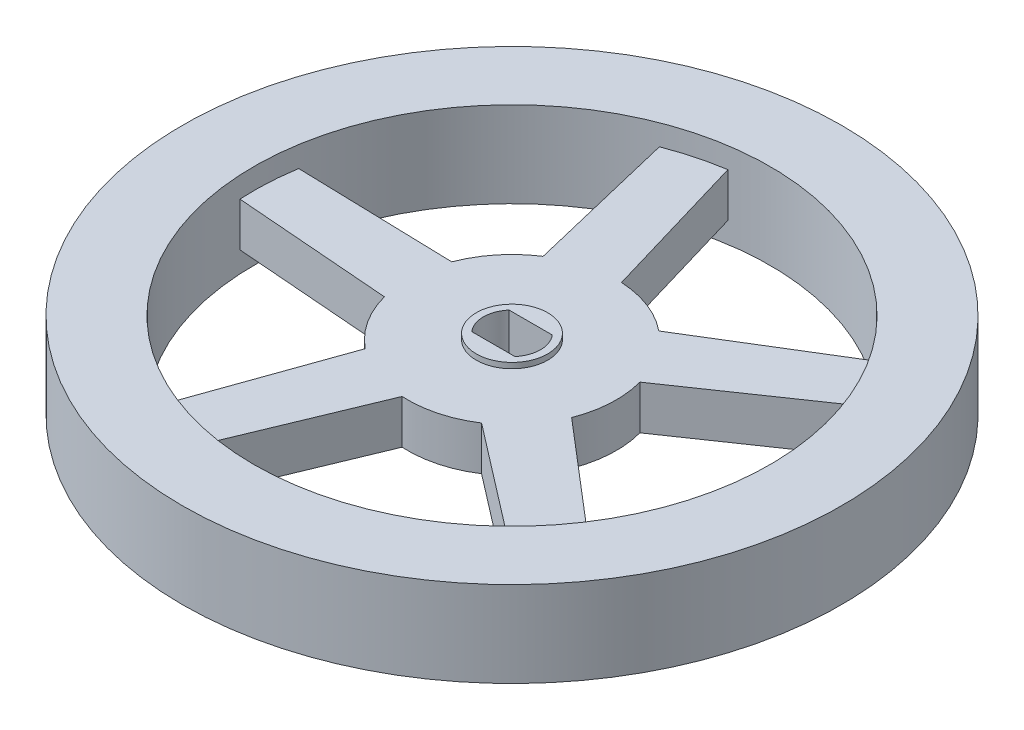
ISO-10303-21;
HEADER;
FILE_DESCRIPTION(('STEP AP214'),'2;1');
FILE_NAME('part.step','',(''),(''),'','','');
FILE_SCHEMA(('AUTOMOTIVE_DESIGN { 1 0 10303 214 1 1 1 1 }'));
ENDSEC;
DATA;
#1=APPLICATION_CONTEXT('core data for automotive mechanical design processes');
#2=APPLICATION_PROTOCOL_DEFINITION('international standard','automotive_design',2000,#1);
#3=PRODUCT_CONTEXT('',#1,'mechanical');
#4=PRODUCT('Part','Part','',(#3));
#5=PRODUCT_RELATED_PRODUCT_CATEGORY('part','',(#4));
#6=PRODUCT_DEFINITION_FORMATION('','',#4);
#7=PRODUCT_DEFINITION_CONTEXT('part definition',#1,'design');
#8=PRODUCT_DEFINITION('design','',#6,#7);
#9=PRODUCT_DEFINITION_SHAPE('','',#8);
#10=(LENGTH_UNIT() NAMED_UNIT(*) SI_UNIT(.MILLI.,.METRE.));
#11=(NAMED_UNIT(*) PLANE_ANGLE_UNIT() SI_UNIT($,.RADIAN.));
#12=(NAMED_UNIT(*) SI_UNIT($,.STERADIAN.) SOLID_ANGLE_UNIT());
#13=UNCERTAINTY_MEASURE_WITH_UNIT(LENGTH_MEASURE(1.E-05),#10,'distance_accuracy_value','');
#14=(GEOMETRIC_REPRESENTATION_CONTEXT(3) GLOBAL_UNCERTAINTY_ASSIGNED_CONTEXT((#13)) GLOBAL_UNIT_ASSIGNED_CONTEXT((#10,
#11,#12)) REPRESENTATION_CONTEXT('',''));
#15=CARTESIAN_POINT('',(0.,0.,0.));
#16=DIRECTION('',(0.,0.,1.));
#17=DIRECTION('',(1.,0.,0.));
#18=AXIS2_PLACEMENT_3D('',#15,#16,#17);
#19=CARTESIAN_POINT('',(-3.0587255926312,4.,0.733926896394335));
#20=DIRECTION('',(-0.972399366290459,0.,0.23332267879037));
#21=DIRECTION('',(0.23332267879037,0.,0.972399366290459));
#22=AXIS2_PLACEMENT_3D('',#19,#20,#21);
#23=PLANE('',#22);
#24=DIRECTION('',(-0.23332267879037,0.,-0.972399366290459));
#25=VECTOR('',#24,1.);
#26=CARTESIAN_POINT('',(-3.0587255926312,0.,0.733926896394335));
#27=LINE('',#26,#25);
#28=CARTESIAN_POINT('',(-5.15025940738791,0.,-7.98278322620703));
#29=VERTEX_POINT('',#28);
#30=CARTESIAN_POINT('',(-8.49246739405931,0.,-21.9118232368016));
#31=VERTEX_POINT('',#30);
#32=EDGE_CURVE('E312',#29,#31,#27,.T.);
#33=ORIENTED_EDGE('',*,*,#32,.F.);
#34=DIRECTION('',(0.,-1.,0.));
#35=VECTOR('',#34,1.);
#36=CARTESIAN_POINT('',(-5.15025940738791,4.,-7.98278322620703));
#37=LINE('',#36,#35);
#38=CARTESIAN_POINT('',(-5.15025940738791,4.,-7.98278322620703));
#39=VERTEX_POINT('',#38);
#40=EDGE_CURVE('E48',#39,#29,#37,.T.);
#41=ORIENTED_EDGE('',*,*,#40,.F.);
#42=DIRECTION('',(-0.23332267879037,0.,-0.972399366290459));
#43=VECTOR('',#42,1.);
#44=CARTESIAN_POINT('',(-3.0587255926312,4.,0.733926896394335));
#45=LINE('',#44,#43);
#46=CARTESIAN_POINT('',(-8.49246739405931,4.,-21.9118232368016));
#47=VERTEX_POINT('',#46);
#48=EDGE_CURVE('E353',#39,#47,#45,.T.);
#49=ORIENTED_EDGE('',*,*,#48,.T.);
#50=DIRECTION('',(0.,-1.,0.));
#51=VECTOR('',#50,1.);
#52=CARTESIAN_POINT('',(-8.49246739405931,4.,-21.9118232368016));
#53=LINE('',#52,#51);
#54=EDGE_CURVE('E11',#47,#31,#53,.T.);
#55=ORIENTED_EDGE('',*,*,#54,.T.);
#56=EDGE_LOOP('',(#33,#41,#49,#55));
#57=FACE_BOUND('',#56,.T.);
#58=ADVANCED_FACE('F41',(#57),#23,.T.);
#59=CARTESIAN_POINT('',(0.,4.,0.));
#60=DIRECTION('',(0.,-1.,0.));
#61=DIRECTION('',(0.,0.,-1.));
#62=AXIS2_PLACEMENT_3D('',#59,#60,#61);
#63=CYLINDRICAL_SURFACE('',#62,9.5);
#64=CARTESIAN_POINT('',(0.,0.,0.));
#65=DIRECTION('',(0.,1.,0.));
#66=DIRECTION('',(0.,0.,1.));
#67=AXIS2_PLACEMENT_3D('',#64,#65,#66);
#68=CIRCLE('',#67,9.5);
#69=CARTESIAN_POINT('',(-8.87498361177693,0.,-3.38890334631771));
#70=VERTEX_POINT('',#69);
#71=EDGE_CURVE('E305',#29,#70,#68,.T.);
#72=ORIENTED_EDGE('',*,*,#71,.T.);
#73=DIRECTION('',(0.,-1.,0.));
#74=VECTOR('',#73,1.);
#75=CARTESIAN_POINT('',(-8.87498361177693,4.,-3.38890334631771));
#76=LINE('',#75,#74);
#77=CARTESIAN_POINT('',(-8.87498361177693,4.,-3.38890334631771));
#78=VERTEX_POINT('',#77);
#79=EDGE_CURVE('E298',#78,#70,#76,.T.);
#80=ORIENTED_EDGE('',*,*,#79,.F.);
#81=CARTESIAN_POINT('',(0.,4.,0.));
#82=DIRECTION('',(0.,1.,0.));
#83=DIRECTION('',(0.,0.,1.));
#84=AXIS2_PLACEMENT_3D('',#81,#82,#83);
#85=CIRCLE('',#84,9.5);
#86=EDGE_CURVE('E306',#39,#78,#85,.T.);
#87=ORIENTED_EDGE('',*,*,#86,.F.);
#88=ORIENTED_EDGE('',*,*,#40,.T.);
#89=EDGE_LOOP('',(#72,#80,#87,#88));
#90=FACE_BOUND('',#89,.T.);
#91=ADVANCED_FACE('F303',(#90),#63,.T.);
#92=CARTESIAN_POINT('',(0.0858062243974081,4.,-3.14437406046434));
#93=DIRECTION('',(-0.0272786543614226,0.,0.999627868267102));
#94=DIRECTION('',(0.999627868267102,0.,0.0272786543614226));
#95=AXIS2_PLACEMENT_3D('',#92,#93,#94);
#96=PLANE('',#95);
#97=DIRECTION('',(-0.999627868267102,0.,-0.0272786543614226));
#98=VECTOR('',#97,1.);
#99=CARTESIAN_POINT('',(0.0858062243974081,0.,-3.14437406046434));
#100=LINE('',#99,#98);
#101=CARTESIAN_POINT('',(-23.1940556468757,0.,-3.77965377377305));
#102=VERTEX_POINT('',#101);
#103=EDGE_CURVE('E314',#70,#102,#100,.T.);
#104=ORIENTED_EDGE('',*,*,#103,.T.);
#105=DIRECTION('',(0.,-1.,0.));
#106=VECTOR('',#105,1.);
#107=CARTESIAN_POINT('',(-23.1940556468757,4.,-3.77965377377305));
#108=LINE('',#107,#106);
#109=CARTESIAN_POINT('',(-23.1940556468757,4.,-3.77965377377305));
#110=VERTEX_POINT('',#109);
#111=EDGE_CURVE('E295',#110,#102,#108,.T.);
#112=ORIENTED_EDGE('',*,*,#111,.F.);
#113=DIRECTION('',(-0.999627868267102,0.,-0.0272786543614226));
#114=VECTOR('',#113,1.);
#115=CARTESIAN_POINT('',(0.0858062243974081,4.,-3.14437406046434));
#116=LINE('',#115,#114);
#117=EDGE_CURVE('E360',#78,#110,#116,.T.);
#118=ORIENTED_EDGE('',*,*,#117,.F.);
#119=ORIENTED_EDGE('',*,*,#79,.T.);
#120=EDGE_LOOP('',(#104,#112,#118,#119));
#121=FACE_BOUND('',#120,.T.);
#122=ADVANCED_FACE('F413',(#121),#96,.F.);
#123=CARTESIAN_POINT('',(-0.24719223195253,4.,3.1358167900456));
#124=DIRECTION('',(-0.078584875440158,0.,0.99690742667113));
#125=DIRECTION('',(0.99690742667113,0.,0.078584875440158));
#126=AXIS2_PLACEMENT_3D('',#123,#124,#125);
#127=PLANE('',#126);
#128=DIRECTION('',(-0.99690742667113,0.,-0.078584875440158));
#129=VECTOR('',#128,1.);
#130=CARTESIAN_POINT('',(-0.24719223195253,0.,3.1358167900456));
#131=LINE('',#130,#129);
#132=CARTESIAN_POINT('',(-9.18359568777773,0.,2.43137209069782));
#133=VERTEX_POINT('',#132);
#134=CARTESIAN_POINT('',(-23.4636990222072,0.,1.3056906966329));
#135=VERTEX_POINT('',#134);
#136=EDGE_CURVE('E327',#133,#135,#131,.T.);
#137=ORIENTED_EDGE('',*,*,#136,.F.);
#138=DIRECTION('',(0.,-1.,0.));
#139=VECTOR('',#138,1.);
#140=CARTESIAN_POINT('',(-9.18359568777773,4.,2.43137209069782));
#141=LINE('',#140,#139);
#142=CARTESIAN_POINT('',(-9.18359568777773,4.,2.43137209069782));
#143=VERTEX_POINT('',#142);
#144=EDGE_CURVE('E290',#143,#133,#141,.T.);
#145=ORIENTED_EDGE('',*,*,#144,.F.);
#146=DIRECTION('',(-0.99690742667113,0.,-0.078584875440158));
#147=VECTOR('',#146,1.);
#148=CARTESIAN_POINT('',(-0.24719223195253,4.,3.1358167900456));
#149=LINE('',#148,#147);
#150=CARTESIAN_POINT('',(-23.4636990222065,4.,1.30569069663296));
#151=VERTEX_POINT('',#150);
#152=EDGE_CURVE('E366',#143,#151,#149,.T.);
#153=ORIENTED_EDGE('',*,*,#152,.T.);
#154=DIRECTION('',(0.,-1.,0.));
#155=VECTOR('',#154,1.);
#156=CARTESIAN_POINT('',(-23.4636990222065,4.,1.30569069663296));
#157=LINE('',#156,#155);
#158=EDGE_CURVE('E292',#151,#135,#157,.T.);
#159=ORIENTED_EDGE('',*,*,#158,.T.);
#160=EDGE_LOOP('',(#137,#145,#153,#159));
#161=FACE_BOUND('',#160,.T.);
#162=ADVANCED_FACE('F419',(#161),#127,.T.);
#163=CARTESIAN_POINT('',(-5.96555937144747,0.,7.39338226968723));
#164=VERTEX_POINT('',#163);
#165=EDGE_CURVE('E233',#133,#164,#68,.T.);
#166=ORIENTED_EDGE('',*,*,#165,.T.);
#167=DIRECTION('',(0.,-1.,0.));
#168=VECTOR('',#167,1.);
#169=CARTESIAN_POINT('',(-5.96555937144747,4.,7.39338226968723));
#170=LINE('',#169,#168);
#171=CARTESIAN_POINT('',(-5.96555937144747,4.,7.39338226968723));
#172=VERTEX_POINT('',#171);
#173=EDGE_CURVE('E287',#172,#164,#170,.T.);
#174=ORIENTED_EDGE('',*,*,#173,.F.);
#175=EDGE_CURVE('E362',#143,#172,#85,.T.);
#176=ORIENTED_EDGE('',*,*,#175,.F.);
#177=ORIENTED_EDGE('',*,*,#144,.T.);
#178=EDGE_LOOP('',(#166,#174,#176,#177));
#179=FACE_BOUND('',#178,.T.);
#180=ADVANCED_FACE('F415',(#179),#63,.T.);
#181=CARTESIAN_POINT('',(-2.96396185831137,4.,-1.05327159020682));
#182=DIRECTION('',(0.942273030204301,0.,0.33484554133153));
#183=DIRECTION('',(0.33484554133153,0.,-0.942273030204301));
#184=AXIS2_PLACEMENT_3D('',#181,#182,#183);
#185=PLANE('',#184);
#186=DIRECTION('',(-0.33484554133153,0.,0.942273030204301));
#187=VECTOR('',#186,1.);
#188=CARTESIAN_POINT('',(-2.96396185831137,0.,-1.05327159020682));
#189=LINE('',#188,#187);
#190=CARTESIAN_POINT('',(-10.7620217142485,0.,20.8908805133246));
#191=VERTEX_POINT('',#190);
#192=EDGE_CURVE('E231',#164,#191,#189,.T.);
#193=ORIENTED_EDGE('',*,*,#192,.T.);
#194=DIRECTION('',(0.,-1.,0.));
#195=VECTOR('',#194,1.);
#196=CARTESIAN_POINT('',(-10.7620217142485,4.,20.8908805133246));
#197=LINE('',#196,#195);
#198=CARTESIAN_POINT('',(-10.7620217142485,4.,20.8908805133246));
#199=VERTEX_POINT('',#198);
#200=EDGE_CURVE('E225',#199,#191,#197,.T.);
#201=ORIENTED_EDGE('',*,*,#200,.F.);
#202=DIRECTION('',(-0.33484554133153,0.,0.942273030204301));
#203=VECTOR('',#202,1.);
#204=CARTESIAN_POINT('',(-2.96396185831137,4.,-1.05327159020682));
#205=LINE('',#204,#203);
#206=EDGE_CURVE('E369',#172,#199,#205,.T.);
#207=ORIENTED_EDGE('',*,*,#206,.F.);
#208=ORIENTED_EDGE('',*,*,#173,.T.);
#209=EDGE_LOOP('',(#193,#201,#207,#208));
#210=FACE_BOUND('',#209,.T.);
#211=ADVANCED_FACE('F422',(#210),#185,.F.);
#212=CARTESIAN_POINT('',(2.90595239153055,4.,1.20411446234669));
#213=DIRECTION('',(0.923831242266764,0.,0.382799994529581));
#214=DIRECTION('',(0.382799994529581,0.,-0.923831242266764));
#215=AXIS2_PLACEMENT_3D('',#212,#213,#214);
#216=PLANE('',#215);
#217=DIRECTION('',(-0.382799994529581,0.,0.923831242266764));
#218=VECTOR('',#217,1.);
#219=CARTESIAN_POINT('',(2.90595239153055,0.,1.20411446234669));
#220=LINE('',#219,#218);
#221=CARTESIAN_POINT('',(-0.525514866594731,0.,9.48545381755582));
#222=VERTEX_POINT('',#221);
#223=CARTESIAN_POINT('',(-6.00889610346141,0.,22.7187844661154));
#224=VERTEX_POINT('',#223);
#225=EDGE_CURVE('E204',#222,#224,#220,.T.);
#226=ORIENTED_EDGE('',*,*,#225,.F.);
#227=DIRECTION('',(0.,-1.,0.));
#228=VECTOR('',#227,1.);
#229=CARTESIAN_POINT('',(-0.525514866594731,4.,9.48545381755582));
#230=LINE('',#229,#228);
#231=CARTESIAN_POINT('',(-0.525514866594731,4.,9.48545381755582));
#232=VERTEX_POINT('',#231);
#233=EDGE_CURVE('E226',#232,#222,#230,.T.);
#234=ORIENTED_EDGE('',*,*,#233,.F.);
#235=DIRECTION('',(-0.382799994529581,0.,0.923831242266764));
#236=VECTOR('',#235,1.);
#237=CARTESIAN_POINT('',(2.90595239153055,4.,1.20411446234669));
#238=LINE('',#237,#236);
#239=CARTESIAN_POINT('',(-6.00889610346117,4.,22.7187844661148));
#240=VERTEX_POINT('',#239);
#241=EDGE_CURVE('E222',#232,#240,#238,.T.);
#242=ORIENTED_EDGE('',*,*,#241,.T.);
#243=DIRECTION('',(0.,-1.,0.));
#244=VECTOR('',#243,1.);
#245=CARTESIAN_POINT('',(-6.00889610346117,4.,22.7187844661148));
#246=LINE('',#245,#244);
#247=EDGE_CURVE('E219',#240,#224,#246,.T.);
#248=ORIENTED_EDGE('',*,*,#247,.T.);
#249=EDGE_LOOP('',(#226,#234,#242,#248));
#250=FACE_BOUND('',#249,.T.);
#251=ADVANCED_FACE('F220',(#250),#216,.T.);
#252=CARTESIAN_POINT('',(5.18806515831765,0.,7.95826488080454));
#253=VERTEX_POINT('',#252);
#254=EDGE_CURVE('E214',#222,#253,#68,.T.);
#255=ORIENTED_EDGE('',*,*,#254,.T.);
#256=DIRECTION('',(0.,-1.,0.));
#257=VECTOR('',#256,1.);
#258=CARTESIAN_POINT('',(5.18806515831765,4.,7.95826488080454));
#259=LINE('',#258,#257);
#260=CARTESIAN_POINT('',(5.18806515831765,4.,7.95826488080454));
#261=VERTEX_POINT('',#260);
#262=EDGE_CURVE('E282',#261,#253,#259,.T.);
#263=ORIENTED_EDGE('',*,*,#262,.F.);
#264=EDGE_CURVE('E374',#232,#261,#85,.T.);
#265=ORIENTED_EDGE('',*,*,#264,.F.);
#266=ORIENTED_EDGE('',*,*,#233,.T.);
#267=EDGE_LOOP('',(#255,#263,#265,#266));
#268=FACE_BOUND('',#267,.T.);
#269=ADVANCED_FACE('F423',(#268),#63,.T.);
#270=CARTESIAN_POINT('',(-1.91763539419199,4.,2.49341641833092));
#271=DIRECTION('',(0.609635413710037,0.,-0.792681942742859));
#272=DIRECTION('',(-0.792681942742859,0.,-0.609635413710037));
#273=AXIS2_PLACEMENT_3D('',#270,#271,#272);
#274=PLANE('',#273);
#275=DIRECTION('',(0.792681942742859,0.,0.609635413710037));
#276=VECTOR('',#275,1.);
#277=CARTESIAN_POINT('',(-1.91763539419199,0.,2.49341641833092));
#278=LINE('',#277,#276);
#279=CARTESIAN_POINT('',(16.5427604398065,0.,16.69092798592));
#280=VERTEX_POINT('',#279);
#281=EDGE_CURVE('E237',#253,#280,#278,.T.);
#282=ORIENTED_EDGE('',*,*,#281,.T.);
#283=DIRECTION('',(0.,-1.,0.));
#284=VECTOR('',#283,1.);
#285=CARTESIAN_POINT('',(16.5427604398065,4.,16.69092798592));
#286=LINE('',#285,#284);
#287=CARTESIAN_POINT('',(16.5427604398065,4.,16.69092798592));
#288=VERTEX_POINT('',#287);
#289=EDGE_CURVE('E279',#288,#280,#286,.T.);
#290=ORIENTED_EDGE('',*,*,#289,.F.);
#291=DIRECTION('',(0.792681942742859,0.,0.609635413710037));
#292=VECTOR('',#291,1.);
#293=CARTESIAN_POINT('',(-1.91763539419199,4.,2.49341641833092));
#294=LINE('',#293,#292);
#295=EDGE_CURVE('E375',#261,#288,#294,.T.);
#296=ORIENTED_EDGE('',*,*,#295,.F.);
#297=ORIENTED_EDGE('',*,*,#262,.T.);
#298=EDGE_LOOP('',(#282,#290,#296,#297));
#299=FACE_BOUND('',#298,.T.);
#300=ADVANCED_FACE('F442',(#299),#274,.F.);
#301=CARTESIAN_POINT('',(2.04316957960767,4.,-2.39163312597102));
#302=DIRECTION('',(0.649543983030057,0.,-0.760324019158575));
#303=DIRECTION('',(-0.760324019158575,0.,-0.649543983030057));
#304=AXIS2_PLACEMENT_3D('',#301,#302,#303);
#305=PLANE('',#304);
#306=DIRECTION('',(0.760324019158575,0.,0.649543983030057));
#307=VECTOR('',#306,1.);
#308=CARTESIAN_POINT('',(2.04316957960767,0.,-2.39163312597102));
#309=LINE('',#308,#307);
#310=CARTESIAN_POINT('',(8.85880963862911,0.,3.43096076726852));
#311=VERTEX_POINT('',#310);
#312=CARTESIAN_POINT('',(19.7499969954013,0.,12.7352902865085));
#313=VERTEX_POINT('',#312);
#314=EDGE_CURVE('E242',#311,#313,#309,.T.);
#315=ORIENTED_EDGE('',*,*,#314,.F.);
#316=DIRECTION('',(0.,-1.,0.));
#317=VECTOR('',#316,1.);
#318=CARTESIAN_POINT('',(8.85880963862911,4.,3.43096076726852));
#319=LINE('',#318,#317);
#320=CARTESIAN_POINT('',(8.85880963862911,4.,3.43096076726852));
#321=VERTEX_POINT('',#320);
#322=EDGE_CURVE('E274',#321,#311,#319,.T.);
#323=ORIENTED_EDGE('',*,*,#322,.F.);
#324=DIRECTION('',(0.760324019158575,0.,0.649543983030057));
#325=VECTOR('',#324,1.);
#326=CARTESIAN_POINT('',(2.04316957960767,4.,-2.39163312597102));
#327=LINE('',#326,#325);
#328=CARTESIAN_POINT('',(19.7499969954014,4.,12.7352902865086));
#329=VERTEX_POINT('',#328);
#330=EDGE_CURVE('E379',#321,#329,#327,.T.);
#331=ORIENTED_EDGE('',*,*,#330,.T.);
#332=DIRECTION('',(0.,-1.,0.));
#333=VECTOR('',#332,1.);
#334=CARTESIAN_POINT('',(19.7499969954014,4.,12.7352902865086));
#335=LINE('',#334,#333);
#336=EDGE_CURVE('E276',#329,#313,#335,.T.);
#337=ORIENTED_EDGE('',*,*,#336,.T.);
#338=EDGE_LOOP('',(#315,#323,#331,#337));
#339=FACE_BOUND('',#338,.T.);
#340=ADVANCED_FACE('F434',(#339),#305,.T.);
#341=CARTESIAN_POINT('',(9.17195997513716,0.,-2.47490408187555));
#342=VERTEX_POINT('',#341);
#343=EDGE_CURVE('E244',#311,#342,#68,.T.);
#344=ORIENTED_EDGE('',*,*,#343,.T.);
#345=DIRECTION('',(0.,-1.,0.));
#346=VECTOR('',#345,1.);
#347=CARTESIAN_POINT('',(9.17195997513716,4.,-2.47490408187555));
#348=LINE('',#347,#346);
#349=CARTESIAN_POINT('',(9.17195997513716,4.,-2.47490408187555));
#350=VERTEX_POINT('',#349);
#351=EDGE_CURVE('E271',#350,#342,#348,.T.);
#352=ORIENTED_EDGE('',*,*,#351,.F.);
#353=EDGE_CURVE('E382',#321,#350,#85,.T.);
#354=ORIENTED_EDGE('',*,*,#353,.F.);
#355=ORIENTED_EDGE('',*,*,#322,.T.);
#356=EDGE_LOOP('',(#344,#352,#354,#355));
#357=FACE_BOUND('',#356,.T.);
#358=ADVANCED_FACE('F426',(#357),#63,.T.);
#359=CARTESIAN_POINT('',(1.77879800667109,4.,2.59428768484282));
#360=DIRECTION('',(-0.565497623785894,0.,-0.824749924214915));
#361=DIRECTION('',(-0.824749924214914,0.,0.565497623785894));
#362=AXIS2_PLACEMENT_3D('',#359,#360,#361);
#363=PLANE('',#362);
#364=DIRECTION('',(0.824749924214915,0.,-0.565497623785894));
#365=VECTOR('',#364,1.);
#366=CARTESIAN_POINT('',(1.77879800667109,0.,2.59428768484282));
#367=LINE('',#366,#365);
#368=CARTESIAN_POINT('',(20.9860099337969,0.,-10.5753197142497));
#369=VERTEX_POINT('',#368);
#370=EDGE_CURVE('E245',#342,#369,#367,.T.);
#371=ORIENTED_EDGE('',*,*,#370,.T.);
#372=DIRECTION('',(0.,-1.,0.));
#373=VECTOR('',#372,1.);
#374=CARTESIAN_POINT('',(20.9860099337969,4.,-10.5753197142497));
#375=LINE('',#374,#373);
#376=CARTESIAN_POINT('',(20.9860099337969,4.,-10.5753197142497));
#377=VERTEX_POINT('',#376);
#378=EDGE_CURVE('E268',#377,#369,#375,.T.);
#379=ORIENTED_EDGE('',*,*,#378,.F.);
#380=DIRECTION('',(0.824749924214915,0.,-0.565497623785894));
#381=VECTOR('',#380,1.);
#382=CARTESIAN_POINT('',(1.77879800667109,4.,2.59428768484282));
#383=LINE('',#382,#381);
#384=EDGE_CURVE('E383',#350,#377,#383,.T.);
#385=ORIENTED_EDGE('',*,*,#384,.F.);
#386=ORIENTED_EDGE('',*,*,#351,.T.);
#387=EDGE_LOOP('',(#371,#379,#385,#386));
#388=FACE_BOUND('',#387,.T.);
#389=ADVANCED_FACE('F432',(#388),#363,.F.);
#390=CARTESIAN_POINT('',(-1.64320414655307,4.,-2.68222502281649));
#391=DIRECTION('',(-0.522390983566204,0.,-0.852706080832507));
#392=DIRECTION('',(-0.852706080832507,0.,0.522390983566204));
#393=AXIS2_PLACEMENT_3D('',#390,#391,#392);
#394=PLANE('',#393);
#395=DIRECTION('',(0.852706080832507,0.,-0.522390983566204));
#396=VECTOR('',#395,1.);
#397=CARTESIAN_POINT('',(-1.64320414655307,0.,-2.68222502281649));
#398=LINE('',#397,#396);
#399=CARTESIAN_POINT('',(6.00056032313339,0.,-7.36500344931647));
#400=VERTEX_POINT('',#399);
#401=CARTESIAN_POINT('',(18.2150655243279,0.,-14.8479422124563));
#402=VERTEX_POINT('',#401);
#403=EDGE_CURVE('E250',#400,#402,#398,.T.);
#404=ORIENTED_EDGE('',*,*,#403,.F.);
#405=DIRECTION('',(0.,-1.,0.));
#406=VECTOR('',#405,1.);
#407=CARTESIAN_POINT('',(6.00056032313339,4.,-7.36500344931647));
#408=LINE('',#407,#406);
#409=CARTESIAN_POINT('',(6.00056032313339,4.,-7.36500344931647));
#410=VERTEX_POINT('',#409);
#411=EDGE_CURVE('E263',#410,#400,#408,.T.);
#412=ORIENTED_EDGE('',*,*,#411,.F.);
#413=DIRECTION('',(0.852706080832507,0.,-0.522390983566204));
#414=VECTOR('',#413,1.);
#415=CARTESIAN_POINT('',(-1.64320414655307,4.,-2.68222502281649));
#416=LINE('',#415,#414);
#417=CARTESIAN_POINT('',(18.2150655243284,4.,-14.8479422124566));
#418=VERTEX_POINT('',#417);
#419=EDGE_CURVE('E387',#410,#418,#416,.T.);
#420=ORIENTED_EDGE('',*,*,#419,.T.);
#421=DIRECTION('',(0.,-1.,0.));
#422=VECTOR('',#421,1.);
#423=CARTESIAN_POINT('',(18.2150655243284,4.,-14.8479422124566));
#424=LINE('',#423,#422);
#425=EDGE_CURVE('E265',#418,#402,#424,.T.);
#426=ORIENTED_EDGE('',*,*,#425,.T.);
#427=EDGE_LOOP('',(#404,#412,#420,#426));
#428=FACE_BOUND('',#427,.T.);
#429=ADVANCED_FACE('F425',(#428),#394,.T.);
#430=CARTESIAN_POINT('',(0.480517849771723,0.,-9.48783972229984));
#431=VERTEX_POINT('',#430);
#432=EDGE_CURVE('E252',#400,#431,#68,.T.);
#433=ORIENTED_EDGE('',*,*,#432,.T.);
#434=DIRECTION('',(0.,-1.,0.));
#435=VECTOR('',#434,1.);
#436=CARTESIAN_POINT('',(0.480517849771723,4.,-9.48783972229984));
#437=LINE('',#436,#435);
#438=CARTESIAN_POINT('',(0.480517849771723,4.,-9.48783972229984));
#439=VERTEX_POINT('',#438);
#440=EDGE_CURVE('E259',#439,#431,#437,.T.);
#441=ORIENTED_EDGE('',*,*,#440,.F.);
#442=EDGE_CURVE('E361',#410,#439,#85,.T.);
#443=ORIENTED_EDGE('',*,*,#442,.F.);
#444=ORIENTED_EDGE('',*,*,#411,.T.);
#445=EDGE_LOOP('',(#433,#441,#443,#444));
#446=FACE_BOUND('',#445,.T.);
#447=ADVANCED_FACE('F340',(#446),#63,.T.);
#448=CARTESIAN_POINT('',(3.01699302143628,4.,-0.890058452503478));
#449=DIRECTION('',(-0.95913216576702,0.,0.282958457359141));
#450=DIRECTION('',(0.282958457359141,0.,0.95913216576702));
#451=AXIS2_PLACEMENT_3D('',#448,#449,#450);
#452=PLANE('',#451);
#453=DIRECTION('',(-0.282958457359141,0.,-0.95913216576702));
#454=VECTOR('',#453,1.);
#455=CARTESIAN_POINT('',(3.01699302143628,0.,-0.890058452503478));
#456=LINE('',#455,#454);
#457=CARTESIAN_POINT('',(-3.57269301247632,0.,-23.2268350112236));
#458=VERTEX_POINT('',#457);
#459=EDGE_CURVE('E253',#431,#458,#456,.T.);
#460=ORIENTED_EDGE('',*,*,#459,.T.);
#461=DIRECTION('',(0.,-1.,0.));
#462=VECTOR('',#461,1.);
#463=CARTESIAN_POINT('',(-3.57269301247632,4.,-23.2268350112236));
#464=LINE('',#463,#462);
#465=CARTESIAN_POINT('',(-3.57269301247632,4.,-23.2268350112236));
#466=VERTEX_POINT('',#465);
#467=EDGE_CURVE('E256',#466,#458,#464,.T.);
#468=ORIENTED_EDGE('',*,*,#467,.F.);
#469=DIRECTION('',(-0.282958457359141,0.,-0.95913216576702));
#470=VECTOR('',#469,1.);
#471=CARTESIAN_POINT('',(3.01699302143628,4.,-0.890058452503478));
#472=LINE('',#471,#470);
#473=EDGE_CURVE('E348',#439,#466,#472,.T.);
#474=ORIENTED_EDGE('',*,*,#473,.F.);
#475=ORIENTED_EDGE('',*,*,#440,.T.);
#476=EDGE_LOOP('',(#460,#468,#474,#475));
#477=FACE_BOUND('',#476,.T.);
#478=ADVANCED_FACE('F346',(#477),#452,.F.);
#479=CARTESIAN_POINT('',(0.,4.,0.));
#480=DIRECTION('',(0.,1.,0.));
#481=DIRECTION('',(0.,0.,1.));
#482=AXIS2_PLACEMENT_3D('',#479,#480,#481);
#483=PLANE('',#482);
#484=CARTESIAN_POINT('',(0.,4.,0.));
#485=DIRECTION('',(0.,1.,0.));
#486=DIRECTION('',(0.,0.,1.));
#487=AXIS2_PLACEMENT_3D('',#484,#485,#486);
#488=CIRCLE('',#487,23.5);
#489=EDGE_CURVE('E255',#466,#47,#488,.T.);
#490=ORIENTED_EDGE('',*,*,#489,.T.);
#491=ORIENTED_EDGE('',*,*,#48,.F.);
#492=ORIENTED_EDGE('',*,*,#86,.T.);
#493=ORIENTED_EDGE('',*,*,#117,.T.);
#494=CARTESIAN_POINT('',(0.,4.,0.));
#495=DIRECTION('',(0.,1.,0.));
#496=DIRECTION('',(0.,0.,1.));
#497=AXIS2_PLACEMENT_3D('',#494,#495,#496);
#498=CIRCLE('',#497,23.5);
#499=EDGE_CURVE('E364',#110,#151,#498,.T.);
#500=ORIENTED_EDGE('',*,*,#499,.T.);
#501=ORIENTED_EDGE('',*,*,#152,.F.);
#502=ORIENTED_EDGE('',*,*,#175,.T.);
#503=ORIENTED_EDGE('',*,*,#206,.T.);
#504=CARTESIAN_POINT('',(0.,4.,0.));
#505=DIRECTION('',(0.,1.,0.));
#506=DIRECTION('',(0.,0.,1.));
#507=AXIS2_PLACEMENT_3D('',#504,#505,#506);
#508=CIRCLE('',#507,23.5);
#509=EDGE_CURVE('E371',#199,#240,#508,.T.);
#510=ORIENTED_EDGE('',*,*,#509,.T.);
#511=ORIENTED_EDGE('',*,*,#241,.F.);
#512=ORIENTED_EDGE('',*,*,#264,.T.);
#513=ORIENTED_EDGE('',*,*,#295,.T.);
#514=CARTESIAN_POINT('',(0.,4.,0.));
#515=DIRECTION('',(0.,1.,0.));
#516=DIRECTION('',(0.,0.,1.));
#517=AXIS2_PLACEMENT_3D('',#514,#515,#516);
#518=CIRCLE('',#517,23.5);
#519=EDGE_CURVE('E377',#288,#329,#518,.T.);
#520=ORIENTED_EDGE('',*,*,#519,.T.);
#521=ORIENTED_EDGE('',*,*,#330,.F.);
#522=ORIENTED_EDGE('',*,*,#353,.T.);
#523=ORIENTED_EDGE('',*,*,#384,.T.);
#524=CARTESIAN_POINT('',(0.,4.,0.));
#525=DIRECTION('',(0.,1.,0.));
#526=DIRECTION('',(0.,0.,1.));
#527=AXIS2_PLACEMENT_3D('',#524,#525,#526);
#528=CIRCLE('',#527,23.5);
#529=EDGE_CURVE('E385',#377,#418,#528,.T.);
#530=ORIENTED_EDGE('',*,*,#529,.T.);
#531=ORIENTED_EDGE('',*,*,#419,.F.);
#532=ORIENTED_EDGE('',*,*,#442,.T.);
#533=ORIENTED_EDGE('',*,*,#473,.T.);
#534=EDGE_LOOP('',(#490,#491,#492,#493,#500,#501,#502,#503,#510,#511,#512,#513,#520,#521,#522,
#523,#530,#531,#532,#533));
#535=FACE_BOUND('',#534,.T.);
#536=CARTESIAN_POINT('',(0.,4.,0.));
#537=DIRECTION('',(0.,1.,0.));
#538=DIRECTION('',(0.,0.,1.));
#539=AXIS2_PLACEMENT_3D('',#536,#537,#538);
#540=CIRCLE('',#539,3.25);
#541=CARTESIAN_POINT('',(0.,4.,3.25));
#542=VERTEX_POINT('',#541);
#543=EDGE_CURVE('E260',#542,#542,#540,.T.);
#544=ORIENTED_EDGE('',*,*,#543,.F.);
#545=EDGE_LOOP('',(#544));
#546=FACE_BOUND('',#545,.T.);
#547=ADVANCED_FACE('F396',(#535,#546),#483,.T.);
#548=CARTESIAN_POINT('',(0.,0.,0.));
#549=DIRECTION('',(0.,1.,0.));
#550=DIRECTION('',(0.,0.,1.));
#551=AXIS2_PLACEMENT_3D('',#548,#549,#550);
#552=PLANE('',#551);
#553=CARTESIAN_POINT('',(0.,0.,0.));
#554=DIRECTION('',(0.,1.,0.));
#555=DIRECTION('',(0.,0.,1.));
#556=AXIS2_PLACEMENT_3D('',#553,#554,#555);
#557=CIRCLE('',#556,23.5);
#558=EDGE_CURVE('E318',#458,#31,#557,.T.);
#559=ORIENTED_EDGE('',*,*,#558,.F.);
#560=ORIENTED_EDGE('',*,*,#459,.F.);
#561=ORIENTED_EDGE('',*,*,#432,.F.);
#562=ORIENTED_EDGE('',*,*,#403,.T.);
#563=CARTESIAN_POINT('',(0.,0.,0.));
#564=DIRECTION('',(0.,1.,0.));
#565=DIRECTION('',(0.,0.,1.));
#566=AXIS2_PLACEMENT_3D('',#563,#564,#565);
#567=CIRCLE('',#566,23.5);
#568=EDGE_CURVE('E247',#369,#402,#567,.T.);
#569=ORIENTED_EDGE('',*,*,#568,.F.);
#570=ORIENTED_EDGE('',*,*,#370,.F.);
#571=ORIENTED_EDGE('',*,*,#343,.F.);
#572=ORIENTED_EDGE('',*,*,#314,.T.);
#573=CARTESIAN_POINT('',(0.,0.,0.));
#574=DIRECTION('',(0.,1.,0.));
#575=DIRECTION('',(0.,0.,1.));
#576=AXIS2_PLACEMENT_3D('',#573,#574,#575);
#577=CIRCLE('',#576,23.5);
#578=EDGE_CURVE('E239',#280,#313,#577,.T.);
#579=ORIENTED_EDGE('',*,*,#578,.F.);
#580=ORIENTED_EDGE('',*,*,#281,.F.);
#581=ORIENTED_EDGE('',*,*,#254,.F.);
#582=ORIENTED_EDGE('',*,*,#225,.T.);
#583=CARTESIAN_POINT('',(0.,0.,0.));
#584=DIRECTION('',(0.,1.,0.));
#585=DIRECTION('',(0.,0.,1.));
#586=AXIS2_PLACEMENT_3D('',#583,#584,#585);
#587=CIRCLE('',#586,23.5);
#588=EDGE_CURVE('E211',#191,#224,#587,.T.);
#589=ORIENTED_EDGE('',*,*,#588,.F.);
#590=ORIENTED_EDGE('',*,*,#192,.F.);
#591=ORIENTED_EDGE('',*,*,#165,.F.);
#592=ORIENTED_EDGE('',*,*,#136,.T.);
#593=CARTESIAN_POINT('',(0.,0.,0.));
#594=DIRECTION('',(0.,1.,0.));
#595=DIRECTION('',(0.,0.,1.));
#596=AXIS2_PLACEMENT_3D('',#593,#594,#595);
#597=CIRCLE('',#596,23.5);
#598=EDGE_CURVE('E325',#102,#135,#597,.T.);
#599=ORIENTED_EDGE('',*,*,#598,.F.);
#600=ORIENTED_EDGE('',*,*,#103,.F.);
#601=ORIENTED_EDGE('',*,*,#71,.F.);
#602=ORIENTED_EDGE('',*,*,#32,.T.);
#603=EDGE_LOOP('',(#559,#560,#561,#562,#569,#570,#571,#572,#579,#580,#581,#582,#589,#590,#591,
#592,#599,#600,#601,#602));
#604=FACE_BOUND('',#603,.T.);
#605=CARTESIAN_POINT('',(0.,0.,0.));
#606=DIRECTION('',(0.,1.,0.));
#607=DIRECTION('',(0.,0.,1.));
#608=AXIS2_PLACEMENT_3D('',#605,#606,#607);
#609=CIRCLE('',#608,1.);
#610=CARTESIAN_POINT('',(0.,0.,1.));
#611=VERTEX_POINT('',#610);
#612=EDGE_CURVE('E537',#611,#611,#609,.T.);
#613=ORIENTED_EDGE('',*,*,#612,.T.);
#614=EDGE_LOOP('',(#613));
#615=FACE_BOUND('',#614,.T.);
#616=ADVANCED_FACE('F207',(#604,#615),#552,.F.);
#617=CARTESIAN_POINT('',(0.,4.5,-1.7));
#618=DIRECTION('',(0.,0.,-1.));
#619=DIRECTION('',(-1.,0.,0.));
#620=AXIS2_PLACEMENT_3D('',#617,#618,#619);
#621=PLANE('',#620);
#622=DIRECTION('',(0.,-1.,0.));
#623=VECTOR('',#622,1.);
#624=CARTESIAN_POINT('',(-1.9672315572906,4.5,-1.7));
#625=LINE('',#624,#623);
#626=CARTESIAN_POINT('',(-1.9672315572906,4.5,-1.7));
#627=VERTEX_POINT('',#626);
#628=CARTESIAN_POINT('',(-1.9672315572906,0.5,-1.7));
#629=VERTEX_POINT('',#628);
#630=EDGE_CURVE('E523',#627,#629,#625,.T.);
#631=ORIENTED_EDGE('',*,*,#630,.T.);
#632=DIRECTION('',(1.,0.,0.));
#633=VECTOR('',#632,1.);
#634=CARTESIAN_POINT('',(0.,0.5,-1.7));
#635=LINE('',#634,#633);
#636=CARTESIAN_POINT('',(1.9672315572906,0.5,-1.7));
#637=VERTEX_POINT('',#636);
#638=EDGE_CURVE('E55',#629,#637,#635,.T.);
#639=ORIENTED_EDGE('',*,*,#638,.T.);
#640=DIRECTION('',(0.,-1.,0.));
#641=VECTOR('',#640,1.);
#642=CARTESIAN_POINT('',(1.9672315572906,4.5,-1.7));
#643=LINE('',#642,#641);
#644=CARTESIAN_POINT('',(1.9672315572906,4.5,-1.7));
#645=VERTEX_POINT('',#644);
#646=EDGE_CURVE('E320',#645,#637,#643,.T.);
#647=ORIENTED_EDGE('',*,*,#646,.F.);
#648=DIRECTION('',(1.,0.,0.));
#649=VECTOR('',#648,1.);
#650=CARTESIAN_POINT('',(0.,4.5,-1.7));
#651=LINE('',#650,#649);
#652=EDGE_CURVE('E524',#627,#645,#651,.T.);
#653=ORIENTED_EDGE('',*,*,#652,.F.);
#654=EDGE_LOOP('',(#631,#639,#647,#653));
#655=FACE_BOUND('',#654,.T.);
#656=ADVANCED_FACE('F403',(#655),#621,.F.);
#657=CARTESIAN_POINT('',(0.,4.5,0.));
#658=DIRECTION('',(0.,-1.,0.));
#659=DIRECTION('',(0.,0.,-1.));
#660=AXIS2_PLACEMENT_3D('',#657,#658,#659);
#661=CYLINDRICAL_SURFACE('',#660,2.6);
#662=CARTESIAN_POINT('',(0.,0.5,0.));
#663=DIRECTION('',(0.,1.,0.));
#664=DIRECTION('',(0.,0.,1.));
#665=AXIS2_PLACEMENT_3D('',#662,#663,#664);
#666=CIRCLE('',#665,2.6);
#667=CARTESIAN_POINT('',(1.9672315572906,0.5,1.7));
#668=VERTEX_POINT('',#667);
#669=EDGE_CURVE('E62',#668,#637,#666,.T.);
#670=ORIENTED_EDGE('',*,*,#669,.F.);
#671=DIRECTION('',(0.,-1.,0.));
#672=VECTOR('',#671,1.);
#673=CARTESIAN_POINT('',(1.9672315572906,4.5,1.7));
#674=LINE('',#673,#672);
#675=CARTESIAN_POINT('',(1.9672315572906,4.5,1.7));
#676=VERTEX_POINT('',#675);
#677=EDGE_CURVE('E558',#676,#668,#674,.T.);
#678=ORIENTED_EDGE('',*,*,#677,.F.);
#679=CARTESIAN_POINT('',(0.,4.5,0.));
#680=DIRECTION('',(0.,1.,0.));
#681=DIRECTION('',(0.,0.,1.));
#682=AXIS2_PLACEMENT_3D('',#679,#680,#681);
#683=CIRCLE('',#682,2.6);
#684=EDGE_CURVE('E549',#676,#645,#683,.T.);
#685=ORIENTED_EDGE('',*,*,#684,.T.);
#686=ORIENTED_EDGE('',*,*,#646,.T.);
#687=EDGE_LOOP('',(#670,#678,#685,#686));
#688=FACE_BOUND('',#687,.T.);
#689=ADVANCED_FACE('F515',(#688),#661,.F.);
#690=CARTESIAN_POINT('',(0.,4.5,1.7));
#691=DIRECTION('',(0.,0.,-1.));
#692=DIRECTION('',(-1.,0.,0.));
#693=AXIS2_PLACEMENT_3D('',#690,#691,#692);
#694=PLANE('',#693);
#695=DIRECTION('',(1.,0.,0.));
#696=VECTOR('',#695,1.);
#697=CARTESIAN_POINT('',(0.,0.5,1.7));
#698=LINE('',#697,#696);
#699=CARTESIAN_POINT('',(-1.9672315572906,0.5,1.7));
#700=VERTEX_POINT('',#699);
#701=EDGE_CURVE('E535',#700,#668,#698,.T.);
#702=ORIENTED_EDGE('',*,*,#701,.F.);
#703=DIRECTION('',(0.,-1.,0.));
#704=VECTOR('',#703,1.);
#705=CARTESIAN_POINT('',(-1.9672315572906,4.5,1.7));
#706=LINE('',#705,#704);
#707=CARTESIAN_POINT('',(-1.9672315572906,4.5,1.7));
#708=VERTEX_POINT('',#707);
#709=EDGE_CURVE('E527',#708,#700,#706,.T.);
#710=ORIENTED_EDGE('',*,*,#709,.F.);
#711=DIRECTION('',(1.,0.,0.));
#712=VECTOR('',#711,1.);
#713=CARTESIAN_POINT('',(0.,4.5,1.7));
#714=LINE('',#713,#712);
#715=EDGE_CURVE('E552',#708,#676,#714,.T.);
#716=ORIENTED_EDGE('',*,*,#715,.T.);
#717=ORIENTED_EDGE('',*,*,#677,.T.);
#718=EDGE_LOOP('',(#702,#710,#716,#717));
#719=FACE_BOUND('',#718,.T.);
#720=ADVANCED_FACE('F513',(#719),#694,.T.);
#721=CARTESIAN_POINT('',(0.,0.5,0.));
#722=DIRECTION('',(0.,1.,0.));
#723=DIRECTION('',(0.,0.,1.));
#724=AXIS2_PLACEMENT_3D('',#721,#722,#723);
#725=CIRCLE('',#724,2.6);
#726=EDGE_CURVE('E533',#629,#700,#725,.T.);
#727=ORIENTED_EDGE('',*,*,#726,.F.);
#728=ORIENTED_EDGE('',*,*,#630,.F.);
#729=EDGE_CURVE('E553',#627,#708,#683,.T.);
#730=ORIENTED_EDGE('',*,*,#729,.T.);
#731=ORIENTED_EDGE('',*,*,#709,.T.);
#732=EDGE_LOOP('',(#727,#728,#730,#731));
#733=FACE_BOUND('',#732,.T.);
#734=ADVANCED_FACE('F510',(#733),#661,.F.);
#735=CARTESIAN_POINT('',(0.,4.5,0.));
#736=DIRECTION('',(0.,-1.,0.));
#737=DIRECTION('',(0.,0.,-1.));
#738=AXIS2_PLACEMENT_3D('',#735,#736,#737);
#739=CYLINDRICAL_SURFACE('',#738,3.25);
#740=ORIENTED_EDGE('',*,*,#543,.T.);
#741=EDGE_LOOP('',(#740));
#742=FACE_BOUND('',#741,.T.);
#743=CARTESIAN_POINT('',(0.,4.5,0.));
#744=DIRECTION('',(0.,1.,0.));
#745=DIRECTION('',(0.,0.,1.));
#746=AXIS2_PLACEMENT_3D('',#743,#744,#745);
#747=CIRCLE('',#746,3.25);
#748=CARTESIAN_POINT('',(0.,4.5,3.25));
#749=VERTEX_POINT('',#748);
#750=EDGE_CURVE('E528',#749,#749,#747,.T.);
#751=ORIENTED_EDGE('',*,*,#750,.F.);
#752=EDGE_LOOP('',(#751));
#753=FACE_BOUND('',#752,.T.);
#754=ADVANCED_FACE('F393',(#742,#753),#739,.T.);
#755=CARTESIAN_POINT('',(0.,4.5,0.));
#756=DIRECTION('',(0.,1.,0.));
#757=DIRECTION('',(0.,0.,1.));
#758=AXIS2_PLACEMENT_3D('',#755,#756,#757);
#759=PLANE('',#758);
#760=ORIENTED_EDGE('',*,*,#652,.T.);
#761=ORIENTED_EDGE('',*,*,#684,.F.);
#762=ORIENTED_EDGE('',*,*,#715,.F.);
#763=ORIENTED_EDGE('',*,*,#729,.F.);
#764=EDGE_LOOP('',(#760,#761,#762,#763));
#765=FACE_BOUND('',#764,.T.);
#766=ORIENTED_EDGE('',*,*,#750,.T.);
#767=EDGE_LOOP('',(#766));
#768=FACE_BOUND('',#767,.T.);
#769=ADVANCED_FACE('F504',(#765,#768),#759,.T.);
#770=CARTESIAN_POINT('',(0.,0.5,0.));
#771=DIRECTION('',(0.,-1.,0.));
#772=DIRECTION('',(0.,0.,-1.));
#773=AXIS2_PLACEMENT_3D('',#770,#771,#772);
#774=CYLINDRICAL_SURFACE('',#773,1.);
#775=CARTESIAN_POINT('',(0.,0.5,0.));
#776=DIRECTION('',(0.,1.,0.));
#777=DIRECTION('',(0.,0.,1.));
#778=AXIS2_PLACEMENT_3D('',#775,#776,#777);
#779=CIRCLE('',#778,1.);
#780=CARTESIAN_POINT('',(0.,0.5,1.));
#781=VERTEX_POINT('',#780);
#782=EDGE_CURVE('E542',#781,#781,#779,.T.);
#783=ORIENTED_EDGE('',*,*,#782,.T.);
#784=EDGE_LOOP('',(#783));
#785=FACE_BOUND('',#784,.T.);
#786=ORIENTED_EDGE('',*,*,#612,.F.);
#787=EDGE_LOOP('',(#786));
#788=FACE_BOUND('',#787,.T.);
#789=ADVANCED_FACE('F497',(#785,#788),#774,.F.);
#790=CARTESIAN_POINT('',(0.,0.5,0.));
#791=DIRECTION('',(0.,1.,0.));
#792=DIRECTION('',(0.,0.,1.));
#793=AXIS2_PLACEMENT_3D('',#790,#791,#792);
#794=PLANE('',#793);
#795=ORIENTED_EDGE('',*,*,#669,.T.);
#796=ORIENTED_EDGE('',*,*,#638,.F.);
#797=ORIENTED_EDGE('',*,*,#726,.T.);
#798=ORIENTED_EDGE('',*,*,#701,.T.);
#799=EDGE_LOOP('',(#795,#796,#797,#798));
#800=FACE_BOUND('',#799,.T.);
#801=ORIENTED_EDGE('',*,*,#782,.F.);
#802=EDGE_LOOP('',(#801));
#803=FACE_BOUND('',#802,.T.);
#804=ADVANCED_FACE('F489',(#800,#803),#794,.T.);
#805=CARTESIAN_POINT('',(0.,-1.9,0.));
#806=DIRECTION('',(0.,1.,0.));
#807=DIRECTION('',(0.,0.,1.));
#808=AXIS2_PLACEMENT_3D('',#805,#806,#807);
#809=CYLINDRICAL_SURFACE('',#808,23.5);
#810=ORIENTED_EDGE('',*,*,#519,.F.);
#811=ORIENTED_EDGE('',*,*,#289,.T.);
#812=ORIENTED_EDGE('',*,*,#578,.T.);
#813=ORIENTED_EDGE('',*,*,#336,.F.);
#814=EDGE_LOOP('',(#810,#811,#812,#813));
#815=FACE_BOUND('',#814,.T.);
#816=ORIENTED_EDGE('',*,*,#529,.F.);
#817=ORIENTED_EDGE('',*,*,#378,.T.);
#818=ORIENTED_EDGE('',*,*,#568,.T.);
#819=ORIENTED_EDGE('',*,*,#425,.F.);
#820=EDGE_LOOP('',(#816,#817,#818,#819));
#821=FACE_BOUND('',#820,.T.);
#822=ORIENTED_EDGE('',*,*,#489,.F.);
#823=ORIENTED_EDGE('',*,*,#467,.T.);
#824=ORIENTED_EDGE('',*,*,#558,.T.);
#825=ORIENTED_EDGE('',*,*,#54,.F.);
#826=EDGE_LOOP('',(#822,#823,#824,#825));
#827=FACE_BOUND('',#826,.T.);
#828=ORIENTED_EDGE('',*,*,#499,.F.);
#829=ORIENTED_EDGE('',*,*,#111,.T.);
#830=ORIENTED_EDGE('',*,*,#598,.T.);
#831=ORIENTED_EDGE('',*,*,#158,.F.);
#832=EDGE_LOOP('',(#828,#829,#830,#831));
#833=FACE_BOUND('',#832,.T.);
#834=ORIENTED_EDGE('',*,*,#509,.F.);
#835=ORIENTED_EDGE('',*,*,#200,.T.);
#836=ORIENTED_EDGE('',*,*,#588,.T.);
#837=ORIENTED_EDGE('',*,*,#247,.F.);
#838=EDGE_LOOP('',(#834,#835,#836,#837));
#839=FACE_BOUND('',#838,.T.);
#840=CARTESIAN_POINT('',(0.,-1.9,0.));
#841=DIRECTION('',(0.,1.,0.));
#842=DIRECTION('',(0.,0.,1.));
#843=AXIS2_PLACEMENT_3D('',#840,#841,#842);
#844=CIRCLE('',#843,23.5);
#845=CARTESIAN_POINT('',(0.,-1.9,23.5));
#846=VERTEX_POINT('',#845);
#847=EDGE_CURVE('E566',#846,#846,#844,.T.);
#848=ORIENTED_EDGE('',*,*,#847,.F.);
#849=EDGE_LOOP('',(#848));
#850=FACE_BOUND('',#849,.T.);
#851=CARTESIAN_POINT('',(0.,5.9,0.));
#852=DIRECTION('',(0.,1.,0.));
#853=DIRECTION('',(0.,0.,1.));
#854=AXIS2_PLACEMENT_3D('',#851,#852,#853);
#855=CIRCLE('',#854,23.5);
#856=CARTESIAN_POINT('',(0.,5.9,23.5));
#857=VERTEX_POINT('',#856);
#858=EDGE_CURVE('E574',#857,#857,#855,.T.);
#859=ORIENTED_EDGE('',*,*,#858,.T.);
#860=EDGE_LOOP('',(#859));
#861=FACE_BOUND('',#860,.T.);
#862=ADVANCED_FACE('F228',(#815,#821,#827,#833,#839,#850,#861),#809,.F.);
#863=CARTESIAN_POINT('',(0.,-1.9,0.));
#864=DIRECTION('',(0.,1.,0.));
#865=DIRECTION('',(0.,0.,1.));
#866=AXIS2_PLACEMENT_3D('',#863,#864,#865);
#867=CYLINDRICAL_SURFACE('',#866,30.);
#868=CARTESIAN_POINT('',(0.,-1.9,0.));
#869=DIRECTION('',(0.,1.,0.));
#870=DIRECTION('',(0.,0.,1.));
#871=AXIS2_PLACEMENT_3D('',#868,#869,#870);
#872=CIRCLE('',#871,30.);
#873=CARTESIAN_POINT('',(0.,-1.9,30.));
#874=VERTEX_POINT('',#873);
#875=EDGE_CURVE('E547',#874,#874,#872,.T.);
#876=CARTESIAN_POINT('',(0.,5.9,0.));
#877=DIRECTION('',(0.,1.,0.));
#878=DIRECTION('',(0.,0.,1.));
#879=AXIS2_PLACEMENT_3D('',#876,#877,#878);
#880=CIRCLE('',#879,30.);
#881=CARTESIAN_POINT('',(0.,5.9,30.));
#882=VERTEX_POINT('',#881);
#883=EDGE_CURVE('E569',#882,#882,#880,.T.);
#884=CARTESIAN_POINT('',(0.,-1.9,30.));
#885=CARTESIAN_POINT('',(0.,-1.81875,30.));
#886=CARTESIAN_POINT('',(0.,-1.7375,30.));
#887=CARTESIAN_POINT('',(0.,-1.575,30.));
#888=CARTESIAN_POINT('',(0.,-1.49375,30.));
#889=CARTESIAN_POINT('',(0.,-1.33125,30.));
#890=CARTESIAN_POINT('',(0.,-1.25,30.));
#891=CARTESIAN_POINT('',(0.,-1.0875,30.));
#892=CARTESIAN_POINT('',(0.,-1.00625,30.));
#893=CARTESIAN_POINT('',(0.,-0.84375,30.));
#894=CARTESIAN_POINT('',(0.,-0.7625,30.));
#895=CARTESIAN_POINT('',(0.,-0.6,30.));
#896=CARTESIAN_POINT('',(0.,-0.51875,30.));
#897=CARTESIAN_POINT('',(0.,-0.35625,30.));
#898=CARTESIAN_POINT('',(0.,-0.275,30.));
#899=CARTESIAN_POINT('',(0.,-0.1125,30.));
#900=CARTESIAN_POINT('',(0.,-0.0312500000000001,30.));
#901=CARTESIAN_POINT('',(0.,0.13125,30.));
#902=CARTESIAN_POINT('',(0.,0.2125,30.));
#903=CARTESIAN_POINT('',(0.,0.375,30.));
#904=CARTESIAN_POINT('',(0.,0.45625,30.));
#905=CARTESIAN_POINT('',(0.,0.61875,30.));
#906=CARTESIAN_POINT('',(0.,0.7,30.));
#907=CARTESIAN_POINT('',(0.,0.8625,30.));
#908=CARTESIAN_POINT('',(0.,0.94375,30.));
#909=CARTESIAN_POINT('',(0.,1.10625,30.));
#910=CARTESIAN_POINT('',(0.,1.1875,30.));
#911=CARTESIAN_POINT('',(0.,1.35,30.));
#912=CARTESIAN_POINT('',(0.,1.43125,30.));
#913=CARTESIAN_POINT('',(0.,1.59375,30.));
#914=CARTESIAN_POINT('',(0.,1.675,30.));
#915=CARTESIAN_POINT('',(0.,1.8375,30.));
#916=CARTESIAN_POINT('',(0.,1.91875,30.));
#917=CARTESIAN_POINT('',(0.,2.08125,30.));
#918=CARTESIAN_POINT('',(0.,2.1625,30.));
#919=CARTESIAN_POINT('',(0.,2.325,30.));
#920=CARTESIAN_POINT('',(0.,2.40625,30.));
#921=CARTESIAN_POINT('',(0.,2.56875,30.));
#922=CARTESIAN_POINT('',(0.,2.65,30.));
#923=CARTESIAN_POINT('',(0.,2.8125,30.));
#924=CARTESIAN_POINT('',(0.,2.89375,30.));
#925=CARTESIAN_POINT('',(0.,3.05625,30.));
#926=CARTESIAN_POINT('',(0.,3.1375,30.));
#927=CARTESIAN_POINT('',(0.,3.3,30.));
#928=CARTESIAN_POINT('',(0.,3.38125,30.));
#929=CARTESIAN_POINT('',(0.,3.54375,30.));
#930=CARTESIAN_POINT('',(0.,3.625,30.));
#931=CARTESIAN_POINT('',(0.,3.7875,30.));
#932=CARTESIAN_POINT('',(0.,3.86875,30.));
#933=CARTESIAN_POINT('',(0.,4.03125,30.));
#934=CARTESIAN_POINT('',(0.,4.1125,30.));
#935=CARTESIAN_POINT('',(0.,4.275,30.));
#936=CARTESIAN_POINT('',(0.,4.35625,30.));
#937=CARTESIAN_POINT('',(0.,4.51875,30.));
#938=CARTESIAN_POINT('',(0.,4.6,30.));
#939=CARTESIAN_POINT('',(0.,4.7625,30.));
#940=CARTESIAN_POINT('',(0.,4.84375,30.));
#941=CARTESIAN_POINT('',(0.,5.00625,30.));
#942=CARTESIAN_POINT('',(0.,5.0875,30.));
#943=CARTESIAN_POINT('',(0.,5.25,30.));
#944=CARTESIAN_POINT('',(0.,5.33125,30.));
#945=CARTESIAN_POINT('',(0.,5.49375,30.));
#946=CARTESIAN_POINT('',(0.,5.575,30.));
#947=CARTESIAN_POINT('',(0.,5.7375,30.));
#948=CARTESIAN_POINT('',(0.,5.81875,30.));
#949=CARTESIAN_POINT('',(0.,5.9,30.));
#950=B_SPLINE_CURVE_WITH_KNOTS('',3,(#884,#885,#886,#887,#888,#889,#890,#891,#892,#893,#894,
#895,#896,#897,#898,#899,#900,#901,#902,#903,#904,#905,#906,#907,#908,#909,#910,#911,#912,#913,
#914,#915,#916,#917,#918,#919,#920,#921,#922,#923,#924,#925,#926,#927,#928,#929,#930,#931,#932,
#933,#934,#935,#936,#937,#938,#939,#940,#941,#942,#943,#944,#945,#946,#947,#948,#949),
.UNSPECIFIED.,.F.,.F.,(4,2,2,2,2,2,2,2,2,2,2,2,2,2,2,2,2,2,2,2,2,2,2,2,2,2,2,2,2,2,2,2,4),(0.,
0.24375,0.4875,0.73125,0.975,1.21875,1.4625,1.70625,1.95,2.19375,2.4375,2.68125,2.925,3.16875,
3.4125,3.65625,3.9,4.14375,4.3875,4.63125,4.875,5.11875,5.3625,5.60625,5.85,6.09375,6.3375,
6.58125,6.825,7.06875,7.3125,7.55625,7.8),.UNSPECIFIED.);
#951=EDGE_CURVE('BSEAM488',#874,#882,#950,.T.);
#952=ORIENTED_EDGE('',*,*,#875,.T.);
#953=ORIENTED_EDGE('',*,*,#883,.F.);
#954=ORIENTED_EDGE('',*,*,#951,.T.);
#955=ORIENTED_EDGE('',*,*,#951,.F.);
#956=EDGE_LOOP('',(#952,#954,#953,#955));
#957=FACE_BOUND('',#956,.T.);
#958=ADVANCED_FACE('F488',(#957),#867,.T.);
#959=CARTESIAN_POINT('',(0.,-1.9,0.));
#960=DIRECTION('',(0.,1.,0.));
#961=DIRECTION('',(0.,0.,1.));
#962=AXIS2_PLACEMENT_3D('',#959,#960,#961);
#963=PLANE('',#962);
#964=ORIENTED_EDGE('',*,*,#847,.T.);
#965=EDGE_LOOP('',(#964));
#966=FACE_BOUND('',#965,.T.);
#967=ORIENTED_EDGE('',*,*,#875,.F.);
#968=EDGE_LOOP('',(#967));
#969=FACE_BOUND('',#968,.T.);
#970=ADVANCED_FACE('F494',(#966,#969),#963,.F.);
#971=CARTESIAN_POINT('',(0.,5.9,0.));
#972=DIRECTION('',(0.,1.,0.));
#973=DIRECTION('',(0.,0.,1.));
#974=AXIS2_PLACEMENT_3D('',#971,#972,#973);
#975=PLANE('',#974);
#976=ORIENTED_EDGE('',*,*,#858,.F.);
#977=EDGE_LOOP('',(#976));
#978=FACE_BOUND('',#977,.T.);
#979=ORIENTED_EDGE('',*,*,#883,.T.);
#980=EDGE_LOOP('',(#979));
#981=FACE_BOUND('',#980,.T.);
#982=ADVANCED_FACE('F579',(#978,#981),#975,.T.);
#983=CLOSED_SHELL('',(#58,#91,#122,#162,#180,#211,#251,#269,#300,#340,#358,#389,#429,#447,#478,
#547,#616,#656,#689,#720,#734,#754,#769,#789,#804,#862,#958,#970,#982));
#984=MANIFOLD_SOLID_BREP('B2',#983);
#985=ADVANCED_BREP_SHAPE_REPRESENTATION('',(#18,#984),#14);
#986=SHAPE_DEFINITION_REPRESENTATION(#9,#985);
ENDSEC;
END-ISO-10303-21;
